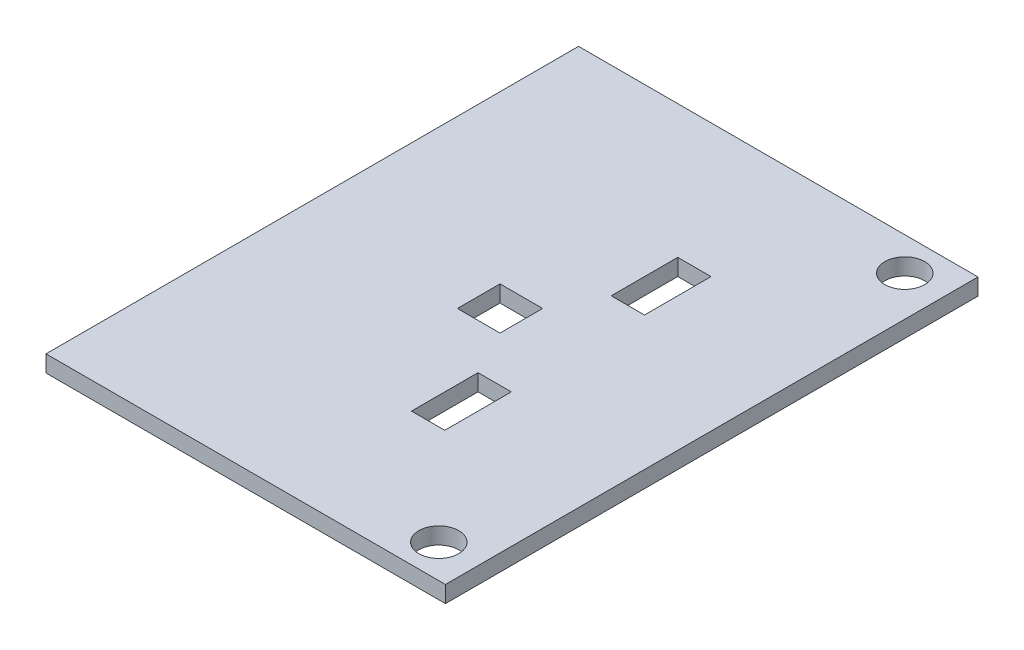
ISO-10303-21;
HEADER;
FILE_DESCRIPTION(('STEP AP214'),'2;1');
FILE_NAME('part.step','',(''),(''),'','','');
FILE_SCHEMA(('AUTOMOTIVE_DESIGN { 1 0 10303 214 1 1 1 1 }'));
ENDSEC;
DATA;
#1=APPLICATION_CONTEXT('core data for automotive mechanical design processes');
#2=APPLICATION_PROTOCOL_DEFINITION('international standard','automotive_design',2000,#1);
#3=PRODUCT_CONTEXT('',#1,'mechanical');
#4=PRODUCT('Part','Part','',(#3));
#5=PRODUCT_RELATED_PRODUCT_CATEGORY('part','',(#4));
#6=PRODUCT_DEFINITION_FORMATION('','',#4);
#7=PRODUCT_DEFINITION_CONTEXT('part definition',#1,'design');
#8=PRODUCT_DEFINITION('design','',#6,#7);
#9=PRODUCT_DEFINITION_SHAPE('','',#8);
#10=(LENGTH_UNIT() NAMED_UNIT(*) SI_UNIT(.MILLI.,.METRE.));
#11=(NAMED_UNIT(*) PLANE_ANGLE_UNIT() SI_UNIT($,.RADIAN.));
#12=(NAMED_UNIT(*) SI_UNIT($,.STERADIAN.) SOLID_ANGLE_UNIT());
#13=UNCERTAINTY_MEASURE_WITH_UNIT(LENGTH_MEASURE(1.E-05),#10,'distance_accuracy_value','');
#14=(GEOMETRIC_REPRESENTATION_CONTEXT(3) GLOBAL_UNCERTAINTY_ASSIGNED_CONTEXT((#13)) GLOBAL_UNIT_ASSIGNED_CONTEXT((#10,
#11,#12)) REPRESENTATION_CONTEXT('',''));
#15=CARTESIAN_POINT('',(0.,0.,0.));
#16=DIRECTION('',(0.,0.,1.));
#17=DIRECTION('',(1.,0.,0.));
#18=AXIS2_PLACEMENT_3D('',#15,#16,#17);
#19=CARTESIAN_POINT('',(0.,3.175,0.));
#20=DIRECTION('',(1.,0.,0.));
#21=DIRECTION('',(0.,0.,-1.));
#22=AXIS2_PLACEMENT_3D('',#19,#20,#21);
#23=PLANE('',#22);
#24=DIRECTION('',(0.,0.,1.));
#25=VECTOR('',#24,1.);
#26=CARTESIAN_POINT('',(0.,0.,0.));
#27=LINE('',#26,#25);
#28=CARTESIAN_POINT('',(0.,0.,-101.6));
#29=VERTEX_POINT('',#28);
#30=CARTESIAN_POINT('',(0.,0.,0.));
#31=VERTEX_POINT('',#30);
#32=EDGE_CURVE('E268',#29,#31,#27,.T.);
#33=ORIENTED_EDGE('',*,*,#32,.T.);
#34=DIRECTION('',(0.,-1.,0.));
#35=VECTOR('',#34,1.);
#36=CARTESIAN_POINT('',(0.,3.175,0.));
#37=LINE('',#36,#35);
#38=CARTESIAN_POINT('',(0.,3.175,0.));
#39=VERTEX_POINT('',#38);
#40=EDGE_CURVE('E11',#39,#31,#37,.T.);
#41=ORIENTED_EDGE('',*,*,#40,.F.);
#42=DIRECTION('',(0.,0.,1.));
#43=VECTOR('',#42,1.);
#44=CARTESIAN_POINT('',(0.,3.175,0.));
#45=LINE('',#44,#43);
#46=CARTESIAN_POINT('',(0.,3.175,-101.6));
#47=VERTEX_POINT('',#46);
#48=EDGE_CURVE('E257',#47,#39,#45,.T.);
#49=ORIENTED_EDGE('',*,*,#48,.F.);
#50=DIRECTION('',(0.,-1.,0.));
#51=VECTOR('',#50,1.);
#52=CARTESIAN_POINT('',(0.,3.175,-101.6));
#53=LINE('',#52,#51);
#54=EDGE_CURVE('E267',#47,#29,#53,.T.);
#55=ORIENTED_EDGE('',*,*,#54,.T.);
#56=EDGE_LOOP('',(#33,#41,#49,#55));
#57=FACE_BOUND('',#56,.T.);
#58=ADVANCED_FACE('F35',(#57),#23,.F.);
#59=CARTESIAN_POINT('',(0.,3.175,0.));
#60=DIRECTION('',(0.,0.,-1.));
#61=DIRECTION('',(-1.,0.,0.));
#62=AXIS2_PLACEMENT_3D('',#59,#60,#61);
#63=PLANE('',#62);
#64=DIRECTION('',(1.,0.,0.));
#65=VECTOR('',#64,1.);
#66=CARTESIAN_POINT('',(0.,0.,0.));
#67=LINE('',#66,#65);
#68=CARTESIAN_POINT('',(76.2,0.,0.));
#69=VERTEX_POINT('',#68);
#70=EDGE_CURVE('E271',#31,#69,#67,.T.);
#71=ORIENTED_EDGE('',*,*,#70,.T.);
#72=DIRECTION('',(0.,-1.,0.));
#73=VECTOR('',#72,1.);
#74=CARTESIAN_POINT('',(76.2,3.175,0.));
#75=LINE('',#74,#73);
#76=CARTESIAN_POINT('',(76.2,3.175,0.));
#77=VERTEX_POINT('',#76);
#78=EDGE_CURVE('E42',#77,#69,#75,.T.);
#79=ORIENTED_EDGE('',*,*,#78,.F.);
#80=DIRECTION('',(1.,0.,0.));
#81=VECTOR('',#80,1.);
#82=CARTESIAN_POINT('',(0.,3.175,0.));
#83=LINE('',#82,#81);
#84=EDGE_CURVE('E260',#39,#77,#83,.T.);
#85=ORIENTED_EDGE('',*,*,#84,.F.);
#86=ORIENTED_EDGE('',*,*,#40,.T.);
#87=EDGE_LOOP('',(#71,#79,#85,#86));
#88=FACE_BOUND('',#87,.T.);
#89=ADVANCED_FACE('F301',(#88),#63,.F.);
#90=CARTESIAN_POINT('',(76.2,3.175,0.));
#91=DIRECTION('',(-1.,0.,0.));
#92=DIRECTION('',(0.,0.,1.));
#93=AXIS2_PLACEMENT_3D('',#90,#91,#92);
#94=PLANE('',#93);
#95=DIRECTION('',(0.,0.,-1.));
#96=VECTOR('',#95,1.);
#97=CARTESIAN_POINT('',(76.2,0.,0.));
#98=LINE('',#97,#96);
#99=CARTESIAN_POINT('',(76.2,0.,-101.6));
#100=VERTEX_POINT('',#99);
#101=EDGE_CURVE('E274',#69,#100,#98,.T.);
#102=ORIENTED_EDGE('',*,*,#101,.T.);
#103=DIRECTION('',(0.,-1.,0.));
#104=VECTOR('',#103,1.);
#105=CARTESIAN_POINT('',(76.2,3.175,-101.6));
#106=LINE('',#105,#104);
#107=CARTESIAN_POINT('',(76.2,3.175,-101.6));
#108=VERTEX_POINT('',#107);
#109=EDGE_CURVE('E279',#108,#100,#106,.T.);
#110=ORIENTED_EDGE('',*,*,#109,.F.);
#111=DIRECTION('',(0.,0.,-1.));
#112=VECTOR('',#111,1.);
#113=CARTESIAN_POINT('',(76.2,3.175,0.));
#114=LINE('',#113,#112);
#115=EDGE_CURVE('E263',#77,#108,#114,.T.);
#116=ORIENTED_EDGE('',*,*,#115,.F.);
#117=ORIENTED_EDGE('',*,*,#78,.T.);
#118=EDGE_LOOP('',(#102,#110,#116,#117));
#119=FACE_BOUND('',#118,.T.);
#120=ADVANCED_FACE('F286',(#119),#94,.F.);
#121=CARTESIAN_POINT('',(0.,3.175,-101.6));
#122=DIRECTION('',(0.,0.,1.));
#123=DIRECTION('',(1.,0.,0.));
#124=AXIS2_PLACEMENT_3D('',#121,#122,#123);
#125=PLANE('',#124);
#126=DIRECTION('',(-1.,0.,0.));
#127=VECTOR('',#126,1.);
#128=CARTESIAN_POINT('',(0.,0.,-101.6));
#129=LINE('',#128,#127);
#130=EDGE_CURVE('E261',#100,#29,#129,.T.);
#131=ORIENTED_EDGE('',*,*,#130,.T.);
#132=ORIENTED_EDGE('',*,*,#54,.F.);
#133=DIRECTION('',(-1.,0.,0.));
#134=VECTOR('',#133,1.);
#135=CARTESIAN_POINT('',(0.,3.175,-101.6));
#136=LINE('',#135,#134);
#137=EDGE_CURVE('E265',#108,#47,#136,.T.);
#138=ORIENTED_EDGE('',*,*,#137,.F.);
#139=ORIENTED_EDGE('',*,*,#109,.T.);
#140=EDGE_LOOP('',(#131,#132,#138,#139));
#141=FACE_BOUND('',#140,.T.);
#142=ADVANCED_FACE('F294',(#141),#125,.F.);
#143=CARTESIAN_POINT('',(0.,3.175,0.));
#144=DIRECTION('',(0.,-1.,0.));
#145=DIRECTION('',(0.,0.,-1.));
#146=AXIS2_PLACEMENT_3D('',#143,#144,#145);
#147=PLANE('',#146);
#148=CARTESIAN_POINT('',(68.58,3.175,-95.25));
#149=DIRECTION('',(0.,1.,0.));
#150=DIRECTION('',(0.,0.,1.));
#151=AXIS2_PLACEMENT_3D('',#148,#149,#150);
#152=CIRCLE('',#151,3.81);
#153=CARTESIAN_POINT('',(68.58,3.175,-91.44));
#154=VERTEX_POINT('',#153);
#155=EDGE_CURVE('E174',#154,#154,#152,.T.);
#156=ORIENTED_EDGE('',*,*,#155,.F.);
#157=EDGE_LOOP('',(#156));
#158=FACE_BOUND('',#157,.T.);
#159=DIRECTION('',(-1.,0.,0.));
#160=VECTOR('',#159,1.);
#161=CARTESIAN_POINT('',(31.75,3.175,-54.864));
#162=LINE('',#161,#160);
#163=CARTESIAN_POINT('',(39.878,3.175,-54.864));
#164=VERTEX_POINT('',#163);
#165=CARTESIAN_POINT('',(31.75,3.175,-54.864));
#166=VERTEX_POINT('',#165);
#167=EDGE_CURVE('E206',#164,#166,#162,.T.);
#168=ORIENTED_EDGE('',*,*,#167,.F.);
#169=DIRECTION('',(0.,0.,-1.));
#170=VECTOR('',#169,1.);
#171=CARTESIAN_POINT('',(39.878,3.175,-54.864));
#172=LINE('',#171,#170);
#173=CARTESIAN_POINT('',(39.878,3.175,-46.736));
#174=VERTEX_POINT('',#173);
#175=EDGE_CURVE('E49',#174,#164,#172,.T.);
#176=ORIENTED_EDGE('',*,*,#175,.F.);
#177=DIRECTION('',(1.,0.,0.));
#178=VECTOR('',#177,1.);
#179=CARTESIAN_POINT('',(31.75,3.175,-46.736));
#180=LINE('',#179,#178);
#181=CARTESIAN_POINT('',(31.75,3.175,-46.736));
#182=VERTEX_POINT('',#181);
#183=EDGE_CURVE('E195',#182,#174,#180,.T.);
#184=ORIENTED_EDGE('',*,*,#183,.F.);
#185=DIRECTION('',(0.,0.,1.));
#186=VECTOR('',#185,1.);
#187=CARTESIAN_POINT('',(31.75,3.175,-54.864));
#188=LINE('',#187,#186);
#189=EDGE_CURVE('E209',#166,#182,#188,.T.);
#190=ORIENTED_EDGE('',*,*,#189,.F.);
#191=EDGE_LOOP('',(#168,#176,#184,#190));
#192=FACE_BOUND('',#191,.T.);
#193=DIRECTION('',(-1.,0.,0.));
#194=VECTOR('',#193,1.);
#195=CARTESIAN_POINT('',(44.323,3.175,-38.1));
#196=LINE('',#195,#194);
#197=CARTESIAN_POINT('',(50.673,3.175,-38.1));
#198=VERTEX_POINT('',#197);
#199=CARTESIAN_POINT('',(44.323,3.175,-38.1));
#200=VERTEX_POINT('',#199);
#201=EDGE_CURVE('E180',#198,#200,#196,.T.);
#202=ORIENTED_EDGE('',*,*,#201,.F.);
#203=DIRECTION('',(0.,0.,-1.));
#204=VECTOR('',#203,1.);
#205=CARTESIAN_POINT('',(50.673,3.175,-38.1));
#206=LINE('',#205,#204);
#207=CARTESIAN_POINT('',(50.673,3.175,-25.4));
#208=VERTEX_POINT('',#207);
#209=EDGE_CURVE('E57',#208,#198,#206,.T.);
#210=ORIENTED_EDGE('',*,*,#209,.F.);
#211=DIRECTION('',(1.,0.,0.));
#212=VECTOR('',#211,1.);
#213=CARTESIAN_POINT('',(44.323,3.175,-25.4));
#214=LINE('',#213,#212);
#215=CARTESIAN_POINT('',(44.323,3.175,-25.4));
#216=VERTEX_POINT('',#215);
#217=EDGE_CURVE('E168',#216,#208,#214,.T.);
#218=ORIENTED_EDGE('',*,*,#217,.F.);
#219=DIRECTION('',(0.,0.,1.));
#220=VECTOR('',#219,1.);
#221=CARTESIAN_POINT('',(44.323,3.175,-38.1));
#222=LINE('',#221,#220);
#223=EDGE_CURVE('E171',#200,#216,#222,.T.);
#224=ORIENTED_EDGE('',*,*,#223,.F.);
#225=EDGE_LOOP('',(#202,#210,#218,#224));
#226=FACE_BOUND('',#225,.T.);
#227=DIRECTION('',(-1.,0.,0.));
#228=VECTOR('',#227,1.);
#229=CARTESIAN_POINT('',(44.323,3.175,-76.2));
#230=LINE('',#229,#228);
#231=CARTESIAN_POINT('',(50.673,3.175,-76.2));
#232=VERTEX_POINT('',#231);
#233=CARTESIAN_POINT('',(44.323,3.175,-76.2));
#234=VERTEX_POINT('',#233);
#235=EDGE_CURVE('E242',#232,#234,#230,.T.);
#236=ORIENTED_EDGE('',*,*,#235,.F.);
#237=DIRECTION('',(0.,0.,-1.));
#238=VECTOR('',#237,1.);
#239=CARTESIAN_POINT('',(50.673,3.175,-76.2));
#240=LINE('',#239,#238);
#241=CARTESIAN_POINT('',(50.673,3.175,-63.5));
#242=VERTEX_POINT('',#241);
#243=EDGE_CURVE('E187',#242,#232,#240,.T.);
#244=ORIENTED_EDGE('',*,*,#243,.F.);
#245=DIRECTION('',(1.,0.,0.));
#246=VECTOR('',#245,1.);
#247=CARTESIAN_POINT('',(44.323,3.175,-63.5));
#248=LINE('',#247,#246);
#249=CARTESIAN_POINT('',(44.323,3.175,-63.5));
#250=VERTEX_POINT('',#249);
#251=EDGE_CURVE('E231',#250,#242,#248,.T.);
#252=ORIENTED_EDGE('',*,*,#251,.F.);
#253=DIRECTION('',(0.,0.,1.));
#254=VECTOR('',#253,1.);
#255=CARTESIAN_POINT('',(44.323,3.175,-76.2));
#256=LINE('',#255,#254);
#257=EDGE_CURVE('E245',#234,#250,#256,.T.);
#258=ORIENTED_EDGE('',*,*,#257,.F.);
#259=EDGE_LOOP('',(#236,#244,#252,#258));
#260=FACE_BOUND('',#259,.T.);
#261=CARTESIAN_POINT('',(68.58,3.175,-6.35));
#262=DIRECTION('',(0.,1.,0.));
#263=DIRECTION('',(0.,0.,1.));
#264=AXIS2_PLACEMENT_3D('',#261,#262,#263);
#265=CIRCLE('',#264,3.81);
#266=CARTESIAN_POINT('',(68.58,3.175,-2.54));
#267=VERTEX_POINT('',#266);
#268=EDGE_CURVE('E223',#267,#267,#265,.T.);
#269=ORIENTED_EDGE('',*,*,#268,.F.);
#270=EDGE_LOOP('',(#269));
#271=FACE_BOUND('',#270,.T.);
#272=ORIENTED_EDGE('',*,*,#48,.T.);
#273=ORIENTED_EDGE('',*,*,#84,.T.);
#274=ORIENTED_EDGE('',*,*,#115,.T.);
#275=ORIENTED_EDGE('',*,*,#137,.T.);
#276=EDGE_LOOP('',(#272,#273,#274,#275));
#277=FACE_BOUND('',#276,.T.);
#278=ADVANCED_FACE('F300',(#158,#192,#226,#260,#271,#277),#147,.F.);
#279=CARTESIAN_POINT('',(0.,0.,0.));
#280=DIRECTION('',(0.,-1.,0.));
#281=DIRECTION('',(0.,0.,-1.));
#282=AXIS2_PLACEMENT_3D('',#279,#280,#281);
#283=PLANE('',#282);
#284=CARTESIAN_POINT('',(68.58,0.,-95.25));
#285=DIRECTION('',(0.,1.,0.));
#286=DIRECTION('',(0.,0.,1.));
#287=AXIS2_PLACEMENT_3D('',#284,#285,#286);
#288=CIRCLE('',#287,3.81);
#289=CARTESIAN_POINT('',(68.58,0.,-91.44));
#290=VERTEX_POINT('',#289);
#291=EDGE_CURVE('E272',#290,#290,#288,.T.);
#292=ORIENTED_EDGE('',*,*,#291,.T.);
#293=EDGE_LOOP('',(#292));
#294=FACE_BOUND('',#293,.T.);
#295=DIRECTION('',(0.,0.,-1.));
#296=VECTOR('',#295,1.);
#297=CARTESIAN_POINT('',(39.878,0.,-54.864));
#298=LINE('',#297,#296);
#299=CARTESIAN_POINT('',(39.878,0.,-46.736));
#300=VERTEX_POINT('',#299);
#301=CARTESIAN_POINT('',(39.878,0.,-54.864));
#302=VERTEX_POINT('',#301);
#303=EDGE_CURVE('E191',#300,#302,#298,.T.);
#304=ORIENTED_EDGE('',*,*,#303,.T.);
#305=DIRECTION('',(-1.,0.,0.));
#306=VECTOR('',#305,1.);
#307=CARTESIAN_POINT('',(31.75,0.,-54.864));
#308=LINE('',#307,#306);
#309=CARTESIAN_POINT('',(31.75,0.,-54.864));
#310=VERTEX_POINT('',#309);
#311=EDGE_CURVE('E194',#302,#310,#308,.T.);
#312=ORIENTED_EDGE('',*,*,#311,.T.);
#313=DIRECTION('',(0.,0.,1.));
#314=VECTOR('',#313,1.);
#315=CARTESIAN_POINT('',(31.75,0.,-54.864));
#316=LINE('',#315,#314);
#317=CARTESIAN_POINT('',(31.75,0.,-46.736));
#318=VERTEX_POINT('',#317);
#319=EDGE_CURVE('E198',#310,#318,#316,.T.);
#320=ORIENTED_EDGE('',*,*,#319,.T.);
#321=DIRECTION('',(1.,0.,0.));
#322=VECTOR('',#321,1.);
#323=CARTESIAN_POINT('',(31.75,0.,-46.736));
#324=LINE('',#323,#322);
#325=EDGE_CURVE('E201',#318,#300,#324,.T.);
#326=ORIENTED_EDGE('',*,*,#325,.T.);
#327=EDGE_LOOP('',(#304,#312,#320,#326));
#328=FACE_BOUND('',#327,.T.);
#329=DIRECTION('',(0.,0.,-1.));
#330=VECTOR('',#329,1.);
#331=CARTESIAN_POINT('',(50.673,0.,-38.1));
#332=LINE('',#331,#330);
#333=CARTESIAN_POINT('',(50.673,0.,-25.4));
#334=VERTEX_POINT('',#333);
#335=CARTESIAN_POINT('',(50.673,0.,-38.1));
#336=VERTEX_POINT('',#335);
#337=EDGE_CURVE('E149',#334,#336,#332,.T.);
#338=ORIENTED_EDGE('',*,*,#337,.T.);
#339=DIRECTION('',(-1.,0.,0.));
#340=VECTOR('',#339,1.);
#341=CARTESIAN_POINT('',(44.323,0.,-38.1));
#342=LINE('',#341,#340);
#343=CARTESIAN_POINT('',(44.323,0.,-38.1));
#344=VERTEX_POINT('',#343);
#345=EDGE_CURVE('E159',#336,#344,#342,.T.);
#346=ORIENTED_EDGE('',*,*,#345,.T.);
#347=DIRECTION('',(0.,0.,1.));
#348=VECTOR('',#347,1.);
#349=CARTESIAN_POINT('',(44.323,0.,-38.1));
#350=LINE('',#349,#348);
#351=CARTESIAN_POINT('',(44.323,0.,-25.4));
#352=VERTEX_POINT('',#351);
#353=EDGE_CURVE('E163',#344,#352,#350,.T.);
#354=ORIENTED_EDGE('',*,*,#353,.T.);
#355=DIRECTION('',(1.,0.,0.));
#356=VECTOR('',#355,1.);
#357=CARTESIAN_POINT('',(44.323,0.,-25.4));
#358=LINE('',#357,#356);
#359=EDGE_CURVE('E155',#352,#334,#358,.T.);
#360=ORIENTED_EDGE('',*,*,#359,.T.);
#361=EDGE_LOOP('',(#338,#346,#354,#360));
#362=FACE_BOUND('',#361,.T.);
#363=DIRECTION('',(0.,0.,-1.));
#364=VECTOR('',#363,1.);
#365=CARTESIAN_POINT('',(50.673,0.,-76.2));
#366=LINE('',#365,#364);
#367=CARTESIAN_POINT('',(50.673,0.,-63.5));
#368=VERTEX_POINT('',#367);
#369=CARTESIAN_POINT('',(50.673,0.,-76.2));
#370=VERTEX_POINT('',#369);
#371=EDGE_CURVE('E227',#368,#370,#366,.T.);
#372=ORIENTED_EDGE('',*,*,#371,.T.);
#373=DIRECTION('',(-1.,0.,0.));
#374=VECTOR('',#373,1.);
#375=CARTESIAN_POINT('',(44.323,0.,-76.2));
#376=LINE('',#375,#374);
#377=CARTESIAN_POINT('',(44.323,0.,-76.2));
#378=VERTEX_POINT('',#377);
#379=EDGE_CURVE('E230',#370,#378,#376,.T.);
#380=ORIENTED_EDGE('',*,*,#379,.T.);
#381=DIRECTION('',(0.,0.,1.));
#382=VECTOR('',#381,1.);
#383=CARTESIAN_POINT('',(44.323,0.,-76.2));
#384=LINE('',#383,#382);
#385=CARTESIAN_POINT('',(44.323,0.,-63.5));
#386=VERTEX_POINT('',#385);
#387=EDGE_CURVE('E234',#378,#386,#384,.T.);
#388=ORIENTED_EDGE('',*,*,#387,.T.);
#389=DIRECTION('',(1.,0.,0.));
#390=VECTOR('',#389,1.);
#391=CARTESIAN_POINT('',(44.323,0.,-63.5));
#392=LINE('',#391,#390);
#393=EDGE_CURVE('E237',#386,#368,#392,.T.);
#394=ORIENTED_EDGE('',*,*,#393,.T.);
#395=EDGE_LOOP('',(#372,#380,#388,#394));
#396=FACE_BOUND('',#395,.T.);
#397=CARTESIAN_POINT('',(68.58,0.,-6.35));
#398=DIRECTION('',(0.,1.,0.));
#399=DIRECTION('',(0.,0.,1.));
#400=AXIS2_PLACEMENT_3D('',#397,#398,#399);
#401=CIRCLE('',#400,3.81);
#402=CARTESIAN_POINT('',(68.58,0.,-2.54));
#403=VERTEX_POINT('',#402);
#404=EDGE_CURVE('E220',#403,#403,#401,.T.);
#405=ORIENTED_EDGE('',*,*,#404,.T.);
#406=EDGE_LOOP('',(#405));
#407=FACE_BOUND('',#406,.T.);
#408=ORIENTED_EDGE('',*,*,#32,.F.);
#409=ORIENTED_EDGE('',*,*,#130,.F.);
#410=ORIENTED_EDGE('',*,*,#101,.F.);
#411=ORIENTED_EDGE('',*,*,#70,.F.);
#412=EDGE_LOOP('',(#408,#409,#410,#411));
#413=FACE_BOUND('',#412,.T.);
#414=ADVANCED_FACE('F165',(#294,#328,#362,#396,#407,#413),#283,.T.);
#415=CARTESIAN_POINT('',(68.58,0.,-6.35));
#416=DIRECTION('',(0.,1.,0.));
#417=DIRECTION('',(0.,0.,1.));
#418=AXIS2_PLACEMENT_3D('',#415,#416,#417);
#419=CYLINDRICAL_SURFACE('',#418,3.81);
#420=ORIENTED_EDGE('',*,*,#404,.F.);
#421=EDGE_LOOP('',(#420));
#422=FACE_BOUND('',#421,.T.);
#423=ORIENTED_EDGE('',*,*,#268,.T.);
#424=EDGE_LOOP('',(#423));
#425=FACE_BOUND('',#424,.T.);
#426=ADVANCED_FACE('F313',(#422,#425),#419,.F.);
#427=CARTESIAN_POINT('',(50.673,0.,-76.2));
#428=DIRECTION('',(1.,0.,0.));
#429=DIRECTION('',(0.,0.,-1.));
#430=AXIS2_PLACEMENT_3D('',#427,#428,#429);
#431=PLANE('',#430);
#432=ORIENTED_EDGE('',*,*,#243,.T.);
#433=DIRECTION('',(0.,1.,0.));
#434=VECTOR('',#433,1.);
#435=CARTESIAN_POINT('',(50.673,0.,-76.2));
#436=LINE('',#435,#434);
#437=EDGE_CURVE('E240',#370,#232,#436,.T.);
#438=ORIENTED_EDGE('',*,*,#437,.F.);
#439=ORIENTED_EDGE('',*,*,#371,.F.);
#440=DIRECTION('',(0.,1.,0.));
#441=VECTOR('',#440,1.);
#442=CARTESIAN_POINT('',(50.673,0.,-63.5));
#443=LINE('',#442,#441);
#444=EDGE_CURVE('E226',#368,#242,#443,.T.);
#445=ORIENTED_EDGE('',*,*,#444,.T.);
#446=EDGE_LOOP('',(#432,#438,#439,#445));
#447=FACE_BOUND('',#446,.T.);
#448=ADVANCED_FACE('F318',(#447),#431,.F.);
#449=CARTESIAN_POINT('',(44.323,0.,-63.5));
#450=DIRECTION('',(0.,0.,1.));
#451=DIRECTION('',(1.,0.,0.));
#452=AXIS2_PLACEMENT_3D('',#449,#450,#451);
#453=PLANE('',#452);
#454=ORIENTED_EDGE('',*,*,#251,.T.);
#455=ORIENTED_EDGE('',*,*,#444,.F.);
#456=ORIENTED_EDGE('',*,*,#393,.F.);
#457=DIRECTION('',(0.,1.,0.));
#458=VECTOR('',#457,1.);
#459=CARTESIAN_POINT('',(44.323,0.,-63.5));
#460=LINE('',#459,#458);
#461=EDGE_CURVE('E251',#386,#250,#460,.T.);
#462=ORIENTED_EDGE('',*,*,#461,.T.);
#463=EDGE_LOOP('',(#454,#455,#456,#462));
#464=FACE_BOUND('',#463,.T.);
#465=ADVANCED_FACE('F321',(#464),#453,.F.);
#466=CARTESIAN_POINT('',(44.323,0.,-76.2));
#467=DIRECTION('',(-1.,0.,0.));
#468=DIRECTION('',(0.,0.,1.));
#469=AXIS2_PLACEMENT_3D('',#466,#467,#468);
#470=PLANE('',#469);
#471=ORIENTED_EDGE('',*,*,#257,.T.);
#472=ORIENTED_EDGE('',*,*,#461,.F.);
#473=ORIENTED_EDGE('',*,*,#387,.F.);
#474=DIRECTION('',(0.,1.,0.));
#475=VECTOR('',#474,1.);
#476=CARTESIAN_POINT('',(44.323,0.,-76.2));
#477=LINE('',#476,#475);
#478=EDGE_CURVE('E253',#378,#234,#477,.T.);
#479=ORIENTED_EDGE('',*,*,#478,.T.);
#480=EDGE_LOOP('',(#471,#472,#473,#479));
#481=FACE_BOUND('',#480,.T.);
#482=ADVANCED_FACE('F326',(#481),#470,.F.);
#483=CARTESIAN_POINT('',(44.323,0.,-76.2));
#484=DIRECTION('',(0.,0.,-1.));
#485=DIRECTION('',(-1.,0.,0.));
#486=AXIS2_PLACEMENT_3D('',#483,#484,#485);
#487=PLANE('',#486);
#488=ORIENTED_EDGE('',*,*,#235,.T.);
#489=ORIENTED_EDGE('',*,*,#478,.F.);
#490=ORIENTED_EDGE('',*,*,#379,.F.);
#491=ORIENTED_EDGE('',*,*,#437,.T.);
#492=EDGE_LOOP('',(#488,#489,#490,#491));
#493=FACE_BOUND('',#492,.T.);
#494=ADVANCED_FACE('F323',(#493),#487,.F.);
#495=CARTESIAN_POINT('',(50.673,0.,-38.1));
#496=DIRECTION('',(1.,0.,0.));
#497=DIRECTION('',(0.,0.,-1.));
#498=AXIS2_PLACEMENT_3D('',#495,#496,#497);
#499=PLANE('',#498);
#500=ORIENTED_EDGE('',*,*,#209,.T.);
#501=DIRECTION('',(0.,1.,0.));
#502=VECTOR('',#501,1.);
#503=CARTESIAN_POINT('',(50.673,0.,-38.1));
#504=LINE('',#503,#502);
#505=EDGE_CURVE('E145',#336,#198,#504,.T.);
#506=ORIENTED_EDGE('',*,*,#505,.F.);
#507=ORIENTED_EDGE('',*,*,#337,.F.);
#508=DIRECTION('',(0.,1.,0.));
#509=VECTOR('',#508,1.);
#510=CARTESIAN_POINT('',(50.673,0.,-25.4));
#511=LINE('',#510,#509);
#512=EDGE_CURVE('E185',#334,#208,#511,.T.);
#513=ORIENTED_EDGE('',*,*,#512,.T.);
#514=EDGE_LOOP('',(#500,#506,#507,#513));
#515=FACE_BOUND('',#514,.T.);
#516=ADVANCED_FACE('F147',(#515),#499,.F.);
#517=CARTESIAN_POINT('',(44.323,0.,-25.4));
#518=DIRECTION('',(0.,0.,1.));
#519=DIRECTION('',(1.,0.,0.));
#520=AXIS2_PLACEMENT_3D('',#517,#518,#519);
#521=PLANE('',#520);
#522=ORIENTED_EDGE('',*,*,#217,.T.);
#523=ORIENTED_EDGE('',*,*,#512,.F.);
#524=ORIENTED_EDGE('',*,*,#359,.F.);
#525=DIRECTION('',(0.,1.,0.));
#526=VECTOR('',#525,1.);
#527=CARTESIAN_POINT('',(44.323,0.,-25.4));
#528=LINE('',#527,#526);
#529=EDGE_CURVE('E188',#352,#216,#528,.T.);
#530=ORIENTED_EDGE('',*,*,#529,.T.);
#531=EDGE_LOOP('',(#522,#523,#524,#530));
#532=FACE_BOUND('',#531,.T.);
#533=ADVANCED_FACE('F355',(#532),#521,.F.);
#534=CARTESIAN_POINT('',(44.323,0.,-38.1));
#535=DIRECTION('',(-1.,0.,0.));
#536=DIRECTION('',(0.,0.,1.));
#537=AXIS2_PLACEMENT_3D('',#534,#535,#536);
#538=PLANE('',#537);
#539=ORIENTED_EDGE('',*,*,#223,.T.);
#540=ORIENTED_EDGE('',*,*,#529,.F.);
#541=ORIENTED_EDGE('',*,*,#353,.F.);
#542=DIRECTION('',(0.,1.,0.));
#543=VECTOR('',#542,1.);
#544=CARTESIAN_POINT('',(44.323,0.,-38.1));
#545=LINE('',#544,#543);
#546=EDGE_CURVE('E154',#344,#200,#545,.T.);
#547=ORIENTED_EDGE('',*,*,#546,.T.);
#548=EDGE_LOOP('',(#539,#540,#541,#547));
#549=FACE_BOUND('',#548,.T.);
#550=ADVANCED_FACE('F358',(#549),#538,.F.);
#551=CARTESIAN_POINT('',(44.323,0.,-38.1));
#552=DIRECTION('',(0.,0.,-1.));
#553=DIRECTION('',(-1.,0.,0.));
#554=AXIS2_PLACEMENT_3D('',#551,#552,#553);
#555=PLANE('',#554);
#556=ORIENTED_EDGE('',*,*,#201,.T.);
#557=ORIENTED_EDGE('',*,*,#546,.F.);
#558=ORIENTED_EDGE('',*,*,#345,.F.);
#559=ORIENTED_EDGE('',*,*,#505,.T.);
#560=EDGE_LOOP('',(#556,#557,#558,#559));
#561=FACE_BOUND('',#560,.T.);
#562=ADVANCED_FACE('F160',(#561),#555,.F.);
#563=CARTESIAN_POINT('',(39.878,0.,-54.864));
#564=DIRECTION('',(1.,0.,0.));
#565=DIRECTION('',(0.,0.,-1.));
#566=AXIS2_PLACEMENT_3D('',#563,#564,#565);
#567=PLANE('',#566);
#568=ORIENTED_EDGE('',*,*,#175,.T.);
#569=DIRECTION('',(0.,1.,0.));
#570=VECTOR('',#569,1.);
#571=CARTESIAN_POINT('',(39.878,0.,-54.864));
#572=LINE('',#571,#570);
#573=EDGE_CURVE('E204',#302,#164,#572,.T.);
#574=ORIENTED_EDGE('',*,*,#573,.F.);
#575=ORIENTED_EDGE('',*,*,#303,.F.);
#576=DIRECTION('',(0.,1.,0.));
#577=VECTOR('',#576,1.);
#578=CARTESIAN_POINT('',(39.878,0.,-46.736));
#579=LINE('',#578,#577);
#580=EDGE_CURVE('E181',#300,#174,#579,.T.);
#581=ORIENTED_EDGE('',*,*,#580,.T.);
#582=EDGE_LOOP('',(#568,#574,#575,#581));
#583=FACE_BOUND('',#582,.T.);
#584=ADVANCED_FACE('F337',(#583),#567,.F.);
#585=CARTESIAN_POINT('',(31.75,0.,-46.736));
#586=DIRECTION('',(0.,0.,1.));
#587=DIRECTION('',(1.,0.,0.));
#588=AXIS2_PLACEMENT_3D('',#585,#586,#587);
#589=PLANE('',#588);
#590=ORIENTED_EDGE('',*,*,#183,.T.);
#591=ORIENTED_EDGE('',*,*,#580,.F.);
#592=ORIENTED_EDGE('',*,*,#325,.F.);
#593=DIRECTION('',(0.,1.,0.));
#594=VECTOR('',#593,1.);
#595=CARTESIAN_POINT('',(31.75,0.,-46.736));
#596=LINE('',#595,#594);
#597=EDGE_CURVE('E215',#318,#182,#596,.T.);
#598=ORIENTED_EDGE('',*,*,#597,.T.);
#599=EDGE_LOOP('',(#590,#591,#592,#598));
#600=FACE_BOUND('',#599,.T.);
#601=ADVANCED_FACE('F340',(#600),#589,.F.);
#602=CARTESIAN_POINT('',(31.75,0.,-54.864));
#603=DIRECTION('',(-1.,0.,0.));
#604=DIRECTION('',(0.,0.,1.));
#605=AXIS2_PLACEMENT_3D('',#602,#603,#604);
#606=PLANE('',#605);
#607=ORIENTED_EDGE('',*,*,#189,.T.);
#608=ORIENTED_EDGE('',*,*,#597,.F.);
#609=ORIENTED_EDGE('',*,*,#319,.F.);
#610=DIRECTION('',(0.,1.,0.));
#611=VECTOR('',#610,1.);
#612=CARTESIAN_POINT('',(31.75,0.,-54.864));
#613=LINE('',#612,#611);
#614=EDGE_CURVE('E217',#310,#166,#613,.T.);
#615=ORIENTED_EDGE('',*,*,#614,.T.);
#616=EDGE_LOOP('',(#607,#608,#609,#615));
#617=FACE_BOUND('',#616,.T.);
#618=ADVANCED_FACE('F345',(#617),#606,.F.);
#619=CARTESIAN_POINT('',(31.75,0.,-54.864));
#620=DIRECTION('',(0.,0.,-1.));
#621=DIRECTION('',(-1.,0.,0.));
#622=AXIS2_PLACEMENT_3D('',#619,#620,#621);
#623=PLANE('',#622);
#624=ORIENTED_EDGE('',*,*,#167,.T.);
#625=ORIENTED_EDGE('',*,*,#614,.F.);
#626=ORIENTED_EDGE('',*,*,#311,.F.);
#627=ORIENTED_EDGE('',*,*,#573,.T.);
#628=EDGE_LOOP('',(#624,#625,#626,#627));
#629=FACE_BOUND('',#628,.T.);
#630=ADVANCED_FACE('F341',(#629),#623,.F.);
#631=CARTESIAN_POINT('',(68.58,0.,-95.25));
#632=DIRECTION('',(0.,1.,0.));
#633=DIRECTION('',(0.,0.,1.));
#634=AXIS2_PLACEMENT_3D('',#631,#632,#633);
#635=CYLINDRICAL_SURFACE('',#634,3.81);
#636=ORIENTED_EDGE('',*,*,#291,.F.);
#637=EDGE_LOOP('',(#636));
#638=FACE_BOUND('',#637,.T.);
#639=ORIENTED_EDGE('',*,*,#155,.T.);
#640=EDGE_LOOP('',(#639));
#641=FACE_BOUND('',#640,.T.);
#642=ADVANCED_FACE('F344',(#638,#641),#635,.F.);
#643=CLOSED_SHELL('',(#58,#89,#120,#142,#278,#414,#426,#448,#465,#482,#494,#516,#533,#550,#562,
#584,#601,#618,#630,#642));
#644=MANIFOLD_SOLID_BREP('B2',#643);
#645=ADVANCED_BREP_SHAPE_REPRESENTATION('',(#18,#644),#14);
#646=SHAPE_DEFINITION_REPRESENTATION(#9,#645);
ENDSEC;
END-ISO-10303-21;
